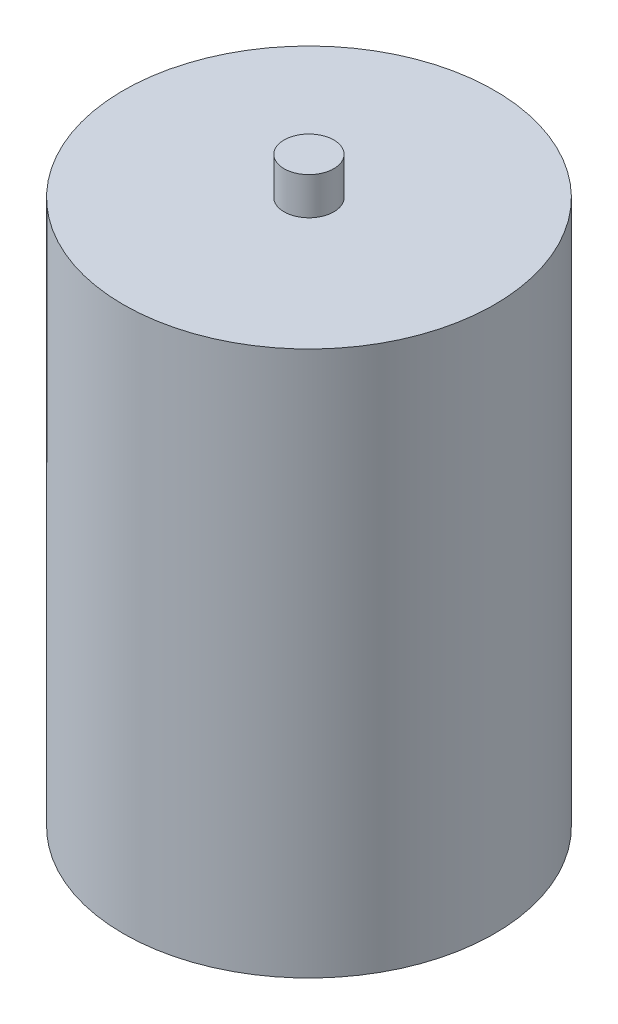
ISO-10303-21;
HEADER;
FILE_DESCRIPTION(('STEP AP214'),'2;1');
FILE_NAME('part.step','',(''),(''),'','','');
FILE_SCHEMA(('AUTOMOTIVE_DESIGN { 1 0 10303 214 1 1 1 1 }'));
ENDSEC;
DATA;
#1=APPLICATION_CONTEXT('core data for automotive mechanical design processes');
#2=APPLICATION_PROTOCOL_DEFINITION('international standard','automotive_design',2000,#1);
#3=PRODUCT_CONTEXT('',#1,'mechanical');
#4=PRODUCT('Part','Part','',(#3));
#5=PRODUCT_RELATED_PRODUCT_CATEGORY('part','',(#4));
#6=PRODUCT_DEFINITION_FORMATION('','',#4);
#7=PRODUCT_DEFINITION_CONTEXT('part definition',#1,'design');
#8=PRODUCT_DEFINITION('design','',#6,#7);
#9=PRODUCT_DEFINITION_SHAPE('','',#8);
#10=(LENGTH_UNIT() NAMED_UNIT(*) SI_UNIT(.MILLI.,.METRE.));
#11=(NAMED_UNIT(*) PLANE_ANGLE_UNIT() SI_UNIT($,.RADIAN.));
#12=(NAMED_UNIT(*) SI_UNIT($,.STERADIAN.) SOLID_ANGLE_UNIT());
#13=UNCERTAINTY_MEASURE_WITH_UNIT(LENGTH_MEASURE(1.E-05),#10,'distance_accuracy_value','');
#14=(GEOMETRIC_REPRESENTATION_CONTEXT(3) GLOBAL_UNCERTAINTY_ASSIGNED_CONTEXT((#13)) GLOBAL_UNIT_ASSIGNED_CONTEXT((#10,
#11,#12)) REPRESENTATION_CONTEXT('',''));
#15=CARTESIAN_POINT('',(0.,0.,0.));
#16=DIRECTION('',(0.,0.,1.));
#17=DIRECTION('',(1.,0.,0.));
#18=AXIS2_PLACEMENT_3D('',#15,#16,#17);
#19=CARTESIAN_POINT('',(0.,369.824,0.));
#20=DIRECTION('',(0.,1.,0.));
#21=DIRECTION('',(0.,0.,1.));
#22=AXIS2_PLACEMENT_3D('',#19,#20,#21);
#23=PLANE('',#22);
#24=CARTESIAN_POINT('',(0.,369.824,0.));
#25=DIRECTION('',(0.,1.,0.));
#26=DIRECTION('',(0.,0.,1.));
#27=AXIS2_PLACEMENT_3D('',#24,#25,#26);
#28=CIRCLE('',#27,125.984);
#29=CARTESIAN_POINT('',(0.,369.824,125.984));
#30=VERTEX_POINT('',#29);
#31=EDGE_CURVE('E10',#30,#30,#28,.T.);
#32=ORIENTED_EDGE('',*,*,#31,.T.);
#33=EDGE_LOOP('',(#32));
#34=FACE_BOUND('',#33,.T.);
#35=CARTESIAN_POINT('',(0.,369.824,0.));
#36=DIRECTION('',(0.,1.,0.));
#37=DIRECTION('',(0.,0.,1.));
#38=AXIS2_PLACEMENT_3D('',#35,#36,#37);
#39=CIRCLE('',#38,16.891);
#40=CARTESIAN_POINT('',(0.,369.824,16.891));
#41=VERTEX_POINT('',#40);
#42=EDGE_CURVE('E42',#41,#41,#39,.T.);
#43=ORIENTED_EDGE('',*,*,#42,.F.);
#44=EDGE_LOOP('',(#43));
#45=FACE_BOUND('',#44,.T.);
#46=ADVANCED_FACE('F29',(#34,#45),#23,.T.);
#47=CARTESIAN_POINT('',(0.,369.824,0.));
#48=DIRECTION('',(0.,-1.,0.));
#49=DIRECTION('',(0.,0.,-1.));
#50=AXIS2_PLACEMENT_3D('',#47,#48,#49);
#51=CYLINDRICAL_SURFACE('',#50,125.984);
#52=ORIENTED_EDGE('',*,*,#31,.F.);
#53=EDGE_LOOP('',(#52));
#54=FACE_BOUND('',#53,.T.);
#55=CARTESIAN_POINT('',(0.,0.,0.));
#56=DIRECTION('',(0.,1.,0.));
#57=DIRECTION('',(0.,0.,1.));
#58=AXIS2_PLACEMENT_3D('',#55,#56,#57);
#59=CIRCLE('',#58,125.984);
#60=CARTESIAN_POINT('',(0.,0.,125.984));
#61=VERTEX_POINT('',#60);
#62=EDGE_CURVE('E33',#61,#61,#59,.T.);
#63=ORIENTED_EDGE('',*,*,#62,.T.);
#64=EDGE_LOOP('',(#63));
#65=FACE_BOUND('',#64,.T.);
#66=ADVANCED_FACE('F31',(#54,#65),#51,.T.);
#67=CARTESIAN_POINT('',(0.,0.,0.));
#68=DIRECTION('',(0.,1.,0.));
#69=DIRECTION('',(0.,0.,1.));
#70=AXIS2_PLACEMENT_3D('',#67,#68,#69);
#71=PLANE('',#70);
#72=ORIENTED_EDGE('',*,*,#62,.F.);
#73=EDGE_LOOP('',(#72));
#74=FACE_BOUND('',#73,.T.);
#75=ADVANCED_FACE('F53',(#74),#71,.F.);
#76=CARTESIAN_POINT('',(0.,395.224,0.));
#77=DIRECTION('',(0.,-1.,0.));
#78=DIRECTION('',(0.,0.,-1.));
#79=AXIS2_PLACEMENT_3D('',#76,#77,#78);
#80=CYLINDRICAL_SURFACE('',#79,16.891);
#81=CARTESIAN_POINT('',(0.,395.224,0.));
#82=DIRECTION('',(0.,1.,0.));
#83=DIRECTION('',(0.,0.,1.));
#84=AXIS2_PLACEMENT_3D('',#81,#82,#83);
#85=CIRCLE('',#84,16.891);
#86=CARTESIAN_POINT('',(0.,395.224,16.891));
#87=VERTEX_POINT('',#86);
#88=EDGE_CURVE('E40',#87,#87,#85,.T.);
#89=ORIENTED_EDGE('',*,*,#88,.F.);
#90=EDGE_LOOP('',(#89));
#91=FACE_BOUND('',#90,.T.);
#92=ORIENTED_EDGE('',*,*,#42,.T.);
#93=EDGE_LOOP('',(#92));
#94=FACE_BOUND('',#93,.T.);
#95=ADVANCED_FACE('F50',(#91,#94),#80,.T.);
#96=CARTESIAN_POINT('',(0.,395.224,0.));
#97=DIRECTION('',(0.,1.,0.));
#98=DIRECTION('',(0.,0.,1.));
#99=AXIS2_PLACEMENT_3D('',#96,#97,#98);
#100=PLANE('',#99);
#101=ORIENTED_EDGE('',*,*,#88,.T.);
#102=EDGE_LOOP('',(#101));
#103=FACE_BOUND('',#102,.T.);
#104=ADVANCED_FACE('F48',(#103),#100,.T.);
#105=CLOSED_SHELL('',(#46,#66,#75,#95,#104));
#106=MANIFOLD_SOLID_BREP('B2',#105);
#107=ADVANCED_BREP_SHAPE_REPRESENTATION('',(#18,#106),#14);
#108=SHAPE_DEFINITION_REPRESENTATION(#9,#107);
ENDSEC;
END-ISO-10303-21;
